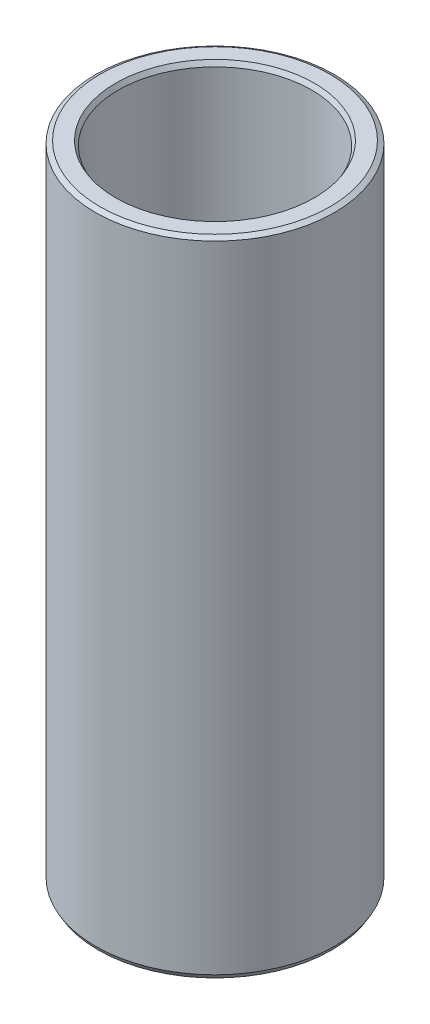
ISO-10303-21;
HEADER;
FILE_DESCRIPTION(('STEP AP214'),'2;1');
FILE_NAME('part.step','',(''),(''),'','','');
FILE_SCHEMA(('AUTOMOTIVE_DESIGN { 1 0 10303 214 1 1 1 1 }'));
ENDSEC;
DATA;
#1=APPLICATION_CONTEXT('core data for automotive mechanical design processes');
#2=APPLICATION_PROTOCOL_DEFINITION('international standard','automotive_design',2000,#1);
#3=PRODUCT_CONTEXT('',#1,'mechanical');
#4=PRODUCT('Part','Part','',(#3));
#5=PRODUCT_RELATED_PRODUCT_CATEGORY('part','',(#4));
#6=PRODUCT_DEFINITION_FORMATION('','',#4);
#7=PRODUCT_DEFINITION_CONTEXT('part definition',#1,'design');
#8=PRODUCT_DEFINITION('design','',#6,#7);
#9=PRODUCT_DEFINITION_SHAPE('','',#8);
#10=(LENGTH_UNIT() NAMED_UNIT(*) SI_UNIT(.MILLI.,.METRE.));
#11=(NAMED_UNIT(*) PLANE_ANGLE_UNIT() SI_UNIT($,.RADIAN.));
#12=(NAMED_UNIT(*) SI_UNIT($,.STERADIAN.) SOLID_ANGLE_UNIT());
#13=UNCERTAINTY_MEASURE_WITH_UNIT(LENGTH_MEASURE(1.E-05),#10,'distance_accuracy_value','');
#14=(GEOMETRIC_REPRESENTATION_CONTEXT(3) GLOBAL_UNCERTAINTY_ASSIGNED_CONTEXT((#13)) GLOBAL_UNIT_ASSIGNED_CONTEXT((#10,
#11,#12)) REPRESENTATION_CONTEXT('',''));
#15=CARTESIAN_POINT('',(0.,0.,0.));
#16=DIRECTION('',(0.,0.,1.));
#17=DIRECTION('',(1.,0.,0.));
#18=AXIS2_PLACEMENT_3D('',#15,#16,#17);
#19=CARTESIAN_POINT('',(0.,282.368057774472,0.));
#20=DIRECTION('',(0.,-1.,0.));
#21=DIRECTION('',(0.,0.,-1.));
#22=AXIS2_PLACEMENT_3D('',#19,#20,#21);
#23=CYLINDRICAL_SURFACE('',#22,52.5);
#24=CARTESIAN_POINT('',(0.,2.02673705367906,0.));
#25=DIRECTION('',(0.,1.,0.));
#26=DIRECTION('',(0.,0.,1.));
#27=AXIS2_PLACEMENT_3D('',#24,#25,#26);
#28=CIRCLE('',#27,52.5);
#29=CARTESIAN_POINT('',(0.,2.02673705367906,-52.5));
#30=VERTEX_POINT('',#29);
#31=EDGE_CURVE('E10',#30,#30,#28,.T.);
#32=CARTESIAN_POINT('',(0.,281.197920590954,0.));
#33=DIRECTION('',(0.,1.,0.));
#34=DIRECTION('',(0.,0.,1.));
#35=AXIS2_PLACEMENT_3D('',#32,#33,#34);
#36=CIRCLE('',#35,52.5);
#37=CARTESIAN_POINT('',(0.,281.197920590954,-52.5));
#38=VERTEX_POINT('',#37);
#39=EDGE_CURVE('E50',#38,#38,#36,.F.);
#40=CARTESIAN_POINT('',(0.,2.02673705367906,-52.5));
#41=CARTESIAN_POINT('',(0.,4.93477021552569,-52.5));
#42=CARTESIAN_POINT('',(0.,7.84280337737231,-52.5));
#43=CARTESIAN_POINT('',(0.,13.6588697010655,-52.5));
#44=CARTESIAN_POINT('',(0.,16.5669028629121,-52.5));
#45=CARTESIAN_POINT('',(0.,22.3829691866054,-52.5));
#46=CARTESIAN_POINT('',(0.,25.291002348452,-52.5));
#47=CARTESIAN_POINT('',(0.,31.1070686721452,-52.5));
#48=CARTESIAN_POINT('',(0.,34.0151018339918,-52.5));
#49=CARTESIAN_POINT('',(0.,39.8311681576851,-52.5));
#50=CARTESIAN_POINT('',(0.,42.7392013195317,-52.5));
#51=CARTESIAN_POINT('',(0.,48.5552676432249,-52.5));
#52=CARTESIAN_POINT('',(0.,51.4633008050715,-52.5));
#53=CARTESIAN_POINT('',(0.,57.2793671287648,-52.5));
#54=CARTESIAN_POINT('',(0.,60.1874002906114,-52.5));
#55=CARTESIAN_POINT('',(0.,66.0034666143046,-52.5));
#56=CARTESIAN_POINT('',(0.,68.9114997761512,-52.5));
#57=CARTESIAN_POINT('',(0.,74.7275660998445,-52.5));
#58=CARTESIAN_POINT('',(0.,77.6355992616911,-52.5));
#59=CARTESIAN_POINT('',(0.,83.4516655853843,-52.5));
#60=CARTESIAN_POINT('',(0.,86.3596987472309,-52.5));
#61=CARTESIAN_POINT('',(0.,92.1757650709241,-52.5));
#62=CARTESIAN_POINT('',(0.,95.0837982327708,-52.5));
#63=CARTESIAN_POINT('',(0.,100.899864556464,-52.5));
#64=CARTESIAN_POINT('',(0.,103.807897718311,-52.5));
#65=CARTESIAN_POINT('',(0.,109.623964042004,-52.5));
#66=CARTESIAN_POINT('',(0.,112.53199720385,-52.5));
#67=CARTESIAN_POINT('',(0.,118.348063527544,-52.5));
#68=CARTESIAN_POINT('',(0.,121.25609668939,-52.5));
#69=CARTESIAN_POINT('',(0.,127.072163013084,-52.5));
#70=CARTESIAN_POINT('',(0.,129.98019617493,-52.5));
#71=CARTESIAN_POINT('',(0.,135.796262498623,-52.5));
#72=CARTESIAN_POINT('',(0.,138.70429566047,-52.5));
#73=CARTESIAN_POINT('',(0.,144.520361984163,-52.5));
#74=CARTESIAN_POINT('',(0.,147.42839514601,-52.5));
#75=CARTESIAN_POINT('',(0.,153.244461469703,-52.5));
#76=CARTESIAN_POINT('',(0.,156.15249463155,-52.5));
#77=CARTESIAN_POINT('',(0.,161.968560955243,-52.5));
#78=CARTESIAN_POINT('',(0.,164.87659411709,-52.5));
#79=CARTESIAN_POINT('',(0.,170.692660440783,-52.5));
#80=CARTESIAN_POINT('',(0.,173.600693602629,-52.5));
#81=CARTESIAN_POINT('',(0.,179.416759926323,-52.5));
#82=CARTESIAN_POINT('',(0.,182.324793088169,-52.5));
#83=CARTESIAN_POINT('',(0.,188.140859411862,-52.5));
#84=CARTESIAN_POINT('',(0.,191.048892573709,-52.5));
#85=CARTESIAN_POINT('',(0.,196.864958897402,-52.5));
#86=CARTESIAN_POINT('',(0.,199.772992059249,-52.5));
#87=CARTESIAN_POINT('',(0.,205.589058382942,-52.5));
#88=CARTESIAN_POINT('',(0.,208.497091544789,-52.5));
#89=CARTESIAN_POINT('',(0.,214.313157868482,-52.5));
#90=CARTESIAN_POINT('',(0.,217.221191030329,-52.5));
#91=CARTESIAN_POINT('',(0.,223.037257354022,-52.5));
#92=CARTESIAN_POINT('',(0.,225.945290515868,-52.5));
#93=CARTESIAN_POINT('',(0.,231.761356839562,-52.5));
#94=CARTESIAN_POINT('',(0.,234.669390001408,-52.5));
#95=CARTESIAN_POINT('',(0.,240.485456325102,-52.5));
#96=CARTESIAN_POINT('',(0.,243.393489486948,-52.5));
#97=CARTESIAN_POINT('',(0.,249.209555810641,-52.5));
#98=CARTESIAN_POINT('',(0.,252.117588972488,-52.5));
#99=CARTESIAN_POINT('',(0.,257.933655296181,-52.5));
#100=CARTESIAN_POINT('',(0.,260.841688458028,-52.5));
#101=CARTESIAN_POINT('',(0.,266.657754781721,-52.5));
#102=CARTESIAN_POINT('',(0.,269.565787943568,-52.5));
#103=CARTESIAN_POINT('',(0.,275.381854267261,-52.5));
#104=CARTESIAN_POINT('',(0.,278.289887429108,-52.5));
#105=CARTESIAN_POINT('',(0.,281.197920590954,-52.5));
#106=B_SPLINE_CURVE_WITH_KNOTS('',3,(#40,#41,#42,#43,#44,#45,#46,#47,#48,#49,#50,#51,#52,#53,
#54,#55,#56,#57,#58,#59,#60,#61,#62,#63,#64,#65,#66,#67,#68,#69,#70,#71,#72,#73,#74,#75,#76,#77,
#78,#79,#80,#81,#82,#83,#84,#85,#86,#87,#88,#89,#90,#91,#92,#93,#94,#95,#96,#97,#98,#99,#100,
#101,#102,#103,#104,#105),.UNSPECIFIED.,.F.,.F.,(4,2,2,2,2,2,2,2,2,2,2,2,2,2,2,2,2,2,2,2,2,2,2,
2,2,2,2,2,2,2,2,2,4),(0.,8.72409948553987,17.4481989710797,26.1722984566196,34.8963979421594,
43.6204974276992,52.3445969132391,61.0686963987789,69.7927958843188,78.5168953698586,
87.2409948553985,95.9650943409383,104.689193826478,113.413293312018,122.137392797558,
130.861492283098,139.585591768638,148.309691254177,157.033790739717,165.757890225257,
174.481989710797,183.206089196337,191.930188681877,200.654288167417,209.378387652956,
218.102487138496,226.826586624036,235.550686109576,244.274785595116,252.998885080656,
261.722984566195,270.447084051735,279.171183537275),.UNSPECIFIED.);
#107=EDGE_CURVE('BSEAM39',#30,#38,#106,.T.);
#108=ORIENTED_EDGE('',*,*,#31,.T.);
#109=ORIENTED_EDGE('',*,*,#39,.T.);
#110=ORIENTED_EDGE('',*,*,#107,.T.);
#111=ORIENTED_EDGE('',*,*,#107,.F.);
#112=EDGE_LOOP('',(#108,#110,#109,#111));
#113=FACE_BOUND('',#112,.T.);
#114=ADVANCED_FACE('F39',(#113),#23,.T.);
#115=CARTESIAN_POINT('',(0.,282.368057774472,0.));
#116=DIRECTION('',(0.,1.,0.));
#117=DIRECTION('',(0.,0.,1.));
#118=AXIS2_PLACEMENT_3D('',#115,#116,#117);
#119=PLANE('',#118);
#120=CARTESIAN_POINT('',(0.,282.368057774472,0.));
#121=DIRECTION('',(0.,1.,0.));
#122=DIRECTION('',(0.,0.,1.));
#123=AXIS2_PLACEMENT_3D('',#120,#121,#122);
#124=CIRCLE('',#123,43.6549569890175);
#125=CARTESIAN_POINT('',(0.,282.368057774472,43.6549569890175));
#126=VERTEX_POINT('',#125);
#127=EDGE_CURVE('E58',#126,#126,#124,.F.);
#128=ORIENTED_EDGE('',*,*,#127,.T.);
#129=EDGE_LOOP('',(#128));
#130=FACE_BOUND('',#129,.T.);
#131=CARTESIAN_POINT('',(0.,282.368057774472,0.));
#132=DIRECTION('',(0.,1.,0.));
#133=DIRECTION('',(0.,0.,1.));
#134=AXIS2_PLACEMENT_3D('',#131,#132,#133);
#135=CIRCLE('',#134,50.4732629463218);
#136=CARTESIAN_POINT('',(0.,282.368057774472,50.4732629463218));
#137=VERTEX_POINT('',#136);
#138=EDGE_CURVE('E61',#137,#137,#135,.T.);
#139=ORIENTED_EDGE('',*,*,#138,.T.);
#140=EDGE_LOOP('',(#139));
#141=FACE_BOUND('',#140,.T.);
#142=ADVANCED_FACE('F88',(#130,#141),#119,.T.);
#143=CARTESIAN_POINT('',(0.,0.,0.));
#144=DIRECTION('',(0.,1.,0.));
#145=DIRECTION('',(0.,0.,1.));
#146=AXIS2_PLACEMENT_3D('',#143,#144,#145);
#147=PLANE('',#146);
#148=CARTESIAN_POINT('',(0.,0.,0.));
#149=DIRECTION('',(0.,1.,0.));
#150=DIRECTION('',(0.,0.,1.));
#151=AXIS2_PLACEMENT_3D('',#148,#149,#150);
#152=CIRCLE('',#151,44.5115568591778);
#153=CARTESIAN_POINT('',(0.,0.,44.5115568591778));
#154=VERTEX_POINT('',#153);
#155=EDGE_CURVE('E51',#154,#154,#152,.T.);
#156=ORIENTED_EDGE('',*,*,#155,.T.);
#157=EDGE_LOOP('',(#156));
#158=FACE_BOUND('',#157,.T.);
#159=CARTESIAN_POINT('',(0.,0.,0.));
#160=DIRECTION('',(0.,1.,0.));
#161=DIRECTION('',(0.,0.,1.));
#162=AXIS2_PLACEMENT_3D('',#159,#160,#161);
#163=CIRCLE('',#162,51.3298628164818);
#164=CARTESIAN_POINT('',(0.,0.,51.3298628164818));
#165=VERTEX_POINT('',#164);
#166=EDGE_CURVE('E54',#165,#165,#163,.F.);
#167=ORIENTED_EDGE('',*,*,#166,.T.);
#168=EDGE_LOOP('',(#167));
#169=FACE_BOUND('',#168,.T.);
#170=ADVANCED_FACE('F83',(#158,#169),#147,.F.);
#171=CARTESIAN_POINT('',(0.,282.368057774472,0.));
#172=DIRECTION('',(0.,-1.,0.));
#173=DIRECTION('',(0.,0.,-1.));
#174=AXIS2_PLACEMENT_3D('',#171,#172,#173);
#175=CYLINDRICAL_SURFACE('',#174,42.4848198054994);
#176=CARTESIAN_POINT('',(0.,280.341320720793,0.));
#177=DIRECTION('',(0.,1.,0.));
#178=DIRECTION('',(0.,0.,1.));
#179=AXIS2_PLACEMENT_3D('',#176,#177,#178);
#180=CIRCLE('',#179,42.4848198054994);
#181=CARTESIAN_POINT('',(0.,280.341320720793,-42.4848198054994));
#182=VERTEX_POINT('',#181);
#183=EDGE_CURVE('E67',#182,#182,#180,.T.);
#184=CARTESIAN_POINT('',(0.,1.17013718351783,0.));
#185=DIRECTION('',(0.,1.,0.));
#186=DIRECTION('',(0.,0.,1.));
#187=AXIS2_PLACEMENT_3D('',#184,#185,#186);
#188=CIRCLE('',#187,42.4848198054994);
#189=CARTESIAN_POINT('',(0.,1.17013718351777,-42.4848198054994));
#190=VERTEX_POINT('',#189);
#191=EDGE_CURVE('E69',#190,#190,#188,.F.);
#192=CARTESIAN_POINT('',(0.,280.341320720793,-42.4848198054994));
#193=CARTESIAN_POINT('',(0.,277.433287558946,-42.4848198054994));
#194=CARTESIAN_POINT('',(0.,274.5252543971,-42.4848198054994));
#195=CARTESIAN_POINT('',(0.,268.709188073407,-42.4848198054994));
#196=CARTESIAN_POINT('',(0.,265.80115491156,-42.4848198054994));
#197=CARTESIAN_POINT('',(0.,259.985088587867,-42.4848198054994));
#198=CARTESIAN_POINT('',(0.,257.07705542602,-42.4848198054994));
#199=CARTESIAN_POINT('',(0.,251.260989102327,-42.4848198054994));
#200=CARTESIAN_POINT('',(0.,248.35295594048,-42.4848198054994));
#201=CARTESIAN_POINT('',(0.,242.536889616787,-42.4848198054994));
#202=CARTESIAN_POINT('',(0.,239.62885645494,-42.4848198054994));
#203=CARTESIAN_POINT('',(0.,233.812790131247,-42.4848198054994));
#204=CARTESIAN_POINT('',(0.,230.904756969401,-42.4848198054994));
#205=CARTESIAN_POINT('',(0.,225.088690645707,-42.4848198054994));
#206=CARTESIAN_POINT('',(0.,222.180657483861,-42.4848198054994));
#207=CARTESIAN_POINT('',(0.,216.364591160167,-42.4848198054994));
#208=CARTESIAN_POINT('',(0.,213.456557998321,-42.4848198054994));
#209=CARTESIAN_POINT('',(0.,207.640491674628,-42.4848198054994));
#210=CARTESIAN_POINT('',(0.,204.732458512781,-42.4848198054994));
#211=CARTESIAN_POINT('',(0.,198.916392189088,-42.4848198054994));
#212=CARTESIAN_POINT('',(0.,196.008359027241,-42.4848198054994));
#213=CARTESIAN_POINT('',(0.,190.192292703548,-42.4848198054994));
#214=CARTESIAN_POINT('',(0.,187.284259541701,-42.4848198054994));
#215=CARTESIAN_POINT('',(0.,181.468193218008,-42.4848198054994));
#216=CARTESIAN_POINT('',(0.,178.560160056161,-42.4848198054994));
#217=CARTESIAN_POINT('',(0.,172.744093732468,-42.4848198054994));
#218=CARTESIAN_POINT('',(0.,169.836060570622,-42.4848198054994));
#219=CARTESIAN_POINT('',(0.,164.019994246928,-42.4848198054994));
#220=CARTESIAN_POINT('',(0.,161.111961085082,-42.4848198054994));
#221=CARTESIAN_POINT('',(0.,155.295894761388,-42.4848198054994));
#222=CARTESIAN_POINT('',(0.,152.387861599542,-42.4848198054994));
#223=CARTESIAN_POINT('',(0.,146.571795275849,-42.4848198054994));
#224=CARTESIAN_POINT('',(0.,143.663762114002,-42.4848198054994));
#225=CARTESIAN_POINT('',(0.,137.847695790309,-42.4848198054994));
#226=CARTESIAN_POINT('',(0.,134.939662628462,-42.4848198054994));
#227=CARTESIAN_POINT('',(0.,129.123596304769,-42.4848198054994));
#228=CARTESIAN_POINT('',(0.,126.215563142922,-42.4848198054994));
#229=CARTESIAN_POINT('',(0.,120.399496819229,-42.4848198054994));
#230=CARTESIAN_POINT('',(0.,117.491463657382,-42.4848198054994));
#231=CARTESIAN_POINT('',(0.,111.675397333689,-42.4848198054994));
#232=CARTESIAN_POINT('',(0.,108.767364171843,-42.4848198054994));
#233=CARTESIAN_POINT('',(0.,102.951297848149,-42.4848198054994));
#234=CARTESIAN_POINT('',(0.,100.043264686303,-42.4848198054994));
#235=CARTESIAN_POINT('',(0.,94.2271983626096,-42.4848198054994));
#236=CARTESIAN_POINT('',(0.,91.3191652007629,-42.4848198054994));
#237=CARTESIAN_POINT('',(0.,85.5030988770697,-42.4848198054994));
#238=CARTESIAN_POINT('',(0.,82.5950657152231,-42.4848198054994));
#239=CARTESIAN_POINT('',(0.,76.7789993915298,-42.4848198054994));
#240=CARTESIAN_POINT('',(0.,73.8709662296832,-42.4848198054994));
#241=CARTESIAN_POINT('',(0.,68.05489990599,-42.4848198054994));
#242=CARTESIAN_POINT('',(0.,65.1468667441434,-42.4848198054994));
#243=CARTESIAN_POINT('',(0.,59.3308004204501,-42.4848198054994));
#244=CARTESIAN_POINT('',(0.,56.4227672586035,-42.4848198054994));
#245=CARTESIAN_POINT('',(0.,50.6067009349103,-42.4848198054994));
#246=CARTESIAN_POINT('',(0.,47.6986677730637,-42.4848198054994));
#247=CARTESIAN_POINT('',(0.,41.8826014493704,-42.4848198054994));
#248=CARTESIAN_POINT('',(0.,38.9745682875238,-42.4848198054994));
#249=CARTESIAN_POINT('',(0.,33.1585019638306,-42.4848198054994));
#250=CARTESIAN_POINT('',(0.,30.250468801984,-42.4848198054994));
#251=CARTESIAN_POINT('',(0.,24.4344024782907,-42.4848198054994));
#252=CARTESIAN_POINT('',(0.,21.5263693164441,-42.4848198054994));
#253=CARTESIAN_POINT('',(0.,15.7103029927509,-42.4848198054994));
#254=CARTESIAN_POINT('',(0.,12.8022698309042,-42.4848198054994));
#255=CARTESIAN_POINT('',(0.,6.98620350721102,-42.4848198054994));
#256=CARTESIAN_POINT('',(0.,4.0781703453644,-42.4848198054994));
#257=CARTESIAN_POINT('',(0.,1.17013718351777,-42.4848198054994));
#258=B_SPLINE_CURVE_WITH_KNOTS('',3,(#192,#193,#194,#195,#196,#197,#198,#199,#200,#201,#202,
#203,#204,#205,#206,#207,#208,#209,#210,#211,#212,#213,#214,#215,#216,#217,#218,#219,#220,#221,
#222,#223,#224,#225,#226,#227,#228,#229,#230,#231,#232,#233,#234,#235,#236,#237,#238,#239,#240,
#241,#242,#243,#244,#245,#246,#247,#248,#249,#250,#251,#252,#253,#254,#255,#256,#257),
.UNSPECIFIED.,.F.,.F.,(4,2,2,2,2,2,2,2,2,2,2,2,2,2,2,2,2,2,2,2,2,2,2,2,2,2,2,2,2,2,2,2,4),(0.,
8.72409948553982,17.4481989710797,26.1722984566196,34.8963979421594,43.6204974276992,
52.3445969132391,61.0686963987789,69.7927958843188,78.5168953698586,87.2409948553985,
95.9650943409384,104.689193826478,113.413293312018,122.137392797558,130.861492283098,
139.585591768638,148.309691254177,157.033790739717,165.757890225257,174.481989710797,
183.206089196337,191.930188681877,200.654288167417,209.378387652956,218.102487138496,
226.826586624036,235.550686109576,244.274785595116,252.998885080656,261.722984566196,
270.447084051735,279.171183537275),.UNSPECIFIED.);
#259=EDGE_CURVE('BSEAM71',#182,#190,#258,.T.);
#260=ORIENTED_EDGE('',*,*,#183,.T.);
#261=ORIENTED_EDGE('',*,*,#191,.T.);
#262=ORIENTED_EDGE('',*,*,#259,.T.);
#263=ORIENTED_EDGE('',*,*,#259,.F.);
#264=EDGE_LOOP('',(#260,#262,#261,#263));
#265=FACE_BOUND('',#264,.T.);
#266=ADVANCED_FACE('F71',(#265),#175,.F.);
#267=CARTESIAN_POINT('',(0.,280.341320720793,0.));
#268=DIRECTION('',(0.,1.,0.));
#269=DIRECTION('',(0.,0.,1.));
#270=AXIS2_PLACEMENT_3D('',#267,#268,#269);
#271=CONICAL_SURFACE('',#270,42.4848198054994,0.523598775598298);
#272=ORIENTED_EDGE('',*,*,#127,.F.);
#273=EDGE_LOOP('',(#272));
#274=FACE_BOUND('',#273,.T.);
#275=ORIENTED_EDGE('',*,*,#183,.F.);
#276=EDGE_LOOP('',(#275));
#277=FACE_BOUND('',#276,.T.);
#278=ADVANCED_FACE('F77',(#274,#277),#271,.F.);
#279=CARTESIAN_POINT('',(0.,0.,0.));
#280=DIRECTION('',(0.,-1.,0.));
#281=DIRECTION('',(0.,0.,-1.));
#282=AXIS2_PLACEMENT_3D('',#279,#280,#281);
#283=CONICAL_SURFACE('',#282,44.5115568591778,1.0471975511966);
#284=ORIENTED_EDGE('',*,*,#191,.F.);
#285=EDGE_LOOP('',(#284));
#286=FACE_BOUND('',#285,.T.);
#287=ORIENTED_EDGE('',*,*,#155,.F.);
#288=EDGE_LOOP('',(#287));
#289=FACE_BOUND('',#288,.T.);
#290=ADVANCED_FACE('F73',(#286,#289),#283,.F.);
#291=CARTESIAN_POINT('',(0.,2.02673705367906,0.));
#292=DIRECTION('',(0.,1.,0.));
#293=DIRECTION('',(0.,0.,1.));
#294=AXIS2_PLACEMENT_3D('',#291,#292,#293);
#295=CONICAL_SURFACE('',#294,52.5,0.523598775598299);
#296=ORIENTED_EDGE('',*,*,#166,.F.);
#297=EDGE_LOOP('',(#296));
#298=FACE_BOUND('',#297,.T.);
#299=ORIENTED_EDGE('',*,*,#31,.F.);
#300=EDGE_LOOP('',(#299));
#301=FACE_BOUND('',#300,.T.);
#302=ADVANCED_FACE('F76',(#298,#301),#295,.T.);
#303=CARTESIAN_POINT('',(0.,282.368057774472,0.));
#304=DIRECTION('',(0.,-1.,0.));
#305=DIRECTION('',(0.,0.,-1.));
#306=AXIS2_PLACEMENT_3D('',#303,#304,#305);
#307=CONICAL_SURFACE('',#306,50.4732629463218,1.04719755119658);
#308=ORIENTED_EDGE('',*,*,#39,.F.);
#309=EDGE_LOOP('',(#308));
#310=FACE_BOUND('',#309,.T.);
#311=ORIENTED_EDGE('',*,*,#138,.F.);
#312=EDGE_LOOP('',(#311));
#313=FACE_BOUND('',#312,.T.);
#314=ADVANCED_FACE('F45',(#310,#313),#307,.T.);
#315=CLOSED_SHELL('',(#114,#142,#170,#266,#278,#290,#302,#314));
#316=MANIFOLD_SOLID_BREP('B2',#315);
#317=ADVANCED_BREP_SHAPE_REPRESENTATION('',(#18,#316),#14);
#318=SHAPE_DEFINITION_REPRESENTATION(#9,#317);
ENDSEC;
END-ISO-10303-21;
